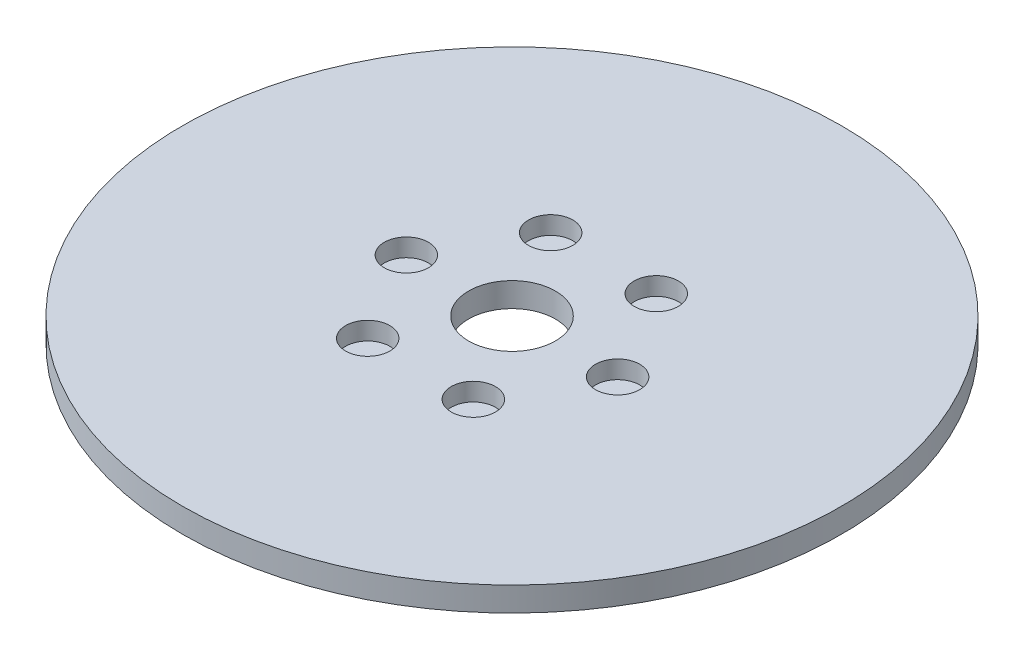
ISO-10303-21;
HEADER;
FILE_DESCRIPTION(('STEP AP214'),'2;1');
FILE_NAME('part.step','',(''),(''),'','','');
FILE_SCHEMA(('AUTOMOTIVE_DESIGN { 1 0 10303 214 1 1 1 1 }'));
ENDSEC;
DATA;
#1=APPLICATION_CONTEXT('core data for automotive mechanical design processes');
#2=APPLICATION_PROTOCOL_DEFINITION('international standard','automotive_design',2000,#1);
#3=PRODUCT_CONTEXT('',#1,'mechanical');
#4=PRODUCT('Part','Part','',(#3));
#5=PRODUCT_RELATED_PRODUCT_CATEGORY('part','',(#4));
#6=PRODUCT_DEFINITION_FORMATION('','',#4);
#7=PRODUCT_DEFINITION_CONTEXT('part definition',#1,'design');
#8=PRODUCT_DEFINITION('design','',#6,#7);
#9=PRODUCT_DEFINITION_SHAPE('','',#8);
#10=(LENGTH_UNIT() NAMED_UNIT(*) SI_UNIT(.MILLI.,.METRE.));
#11=(NAMED_UNIT(*) PLANE_ANGLE_UNIT() SI_UNIT($,.RADIAN.));
#12=(NAMED_UNIT(*) SI_UNIT($,.STERADIAN.) SOLID_ANGLE_UNIT());
#13=UNCERTAINTY_MEASURE_WITH_UNIT(LENGTH_MEASURE(1.E-05),#10,'distance_accuracy_value','');
#14=(GEOMETRIC_REPRESENTATION_CONTEXT(3) GLOBAL_UNCERTAINTY_ASSIGNED_CONTEXT((#13)) GLOBAL_UNIT_ASSIGNED_CONTEXT((#10,
#11,#12)) REPRESENTATION_CONTEXT('',''));
#15=CARTESIAN_POINT('',(0.,0.,0.));
#16=DIRECTION('',(0.,0.,1.));
#17=DIRECTION('',(1.,0.,0.));
#18=AXIS2_PLACEMENT_3D('',#15,#16,#17);
#19=CARTESIAN_POINT('',(0.,7.,0.));
#20=DIRECTION('',(0.,-1.,0.));
#21=DIRECTION('',(0.,0.,-1.));
#22=AXIS2_PLACEMENT_3D('',#19,#20,#21);
#23=CYLINDRICAL_SURFACE('',#22,95.);
#24=CARTESIAN_POINT('',(0.,7.,0.));
#25=DIRECTION('',(0.,1.,0.));
#26=DIRECTION('',(0.,0.,1.));
#27=AXIS2_PLACEMENT_3D('',#24,#25,#26);
#28=CIRCLE('',#27,95.);
#29=CARTESIAN_POINT('',(0.,7.,95.));
#30=VERTEX_POINT('',#29);
#31=EDGE_CURVE('E10',#30,#30,#28,.T.);
#32=ORIENTED_EDGE('',*,*,#31,.F.);
#33=EDGE_LOOP('',(#32));
#34=FACE_BOUND('',#33,.T.);
#35=CARTESIAN_POINT('',(0.,0.,0.));
#36=DIRECTION('',(0.,1.,0.));
#37=DIRECTION('',(0.,0.,1.));
#38=AXIS2_PLACEMENT_3D('',#35,#36,#37);
#39=CIRCLE('',#38,95.);
#40=CARTESIAN_POINT('',(0.,0.,95.));
#41=VERTEX_POINT('',#40);
#42=EDGE_CURVE('E37',#41,#41,#39,.T.);
#43=ORIENTED_EDGE('',*,*,#42,.T.);
#44=EDGE_LOOP('',(#43));
#45=FACE_BOUND('',#44,.T.);
#46=ADVANCED_FACE('F40',(#34,#45),#23,.T.);
#47=CARTESIAN_POINT('',(0.,7.,0.));
#48=DIRECTION('',(0.,1.,0.));
#49=DIRECTION('',(0.,0.,1.));
#50=AXIS2_PLACEMENT_3D('',#47,#48,#49);
#51=PLANE('',#50);
#52=CARTESIAN_POINT('',(-15.2232237533096,7.,-26.3673969957209));
#53=DIRECTION('',(0.,1.,0.));
#54=DIRECTION('',(-0.866025403784433,0.,0.50000000000001));
#55=AXIS2_PLACEMENT_3D('',#52,#53,#54);
#56=CIRCLE('',#55,6.36960719544827);
#57=CARTESIAN_POINT('',(-20.7394653966959,7.,-23.1825933979967));
#58=VERTEX_POINT('',#57);
#59=EDGE_CURVE('E70',#58,#58,#56,.T.);
#60=ORIENTED_EDGE('',*,*,#59,.F.);
#61=EDGE_LOOP('',(#60));
#62=FACE_BOUND('',#61,.T.);
#63=CARTESIAN_POINT('',(15.223223753309,7.,-26.3673969957212));
#64=DIRECTION('',(0.,1.,0.));
#65=DIRECTION('',(-0.866025403784443,0.,-0.499999999999992));
#66=AXIS2_PLACEMENT_3D('',#63,#64,#65);
#67=CIRCLE('',#66,6.36960719544827);
#68=CARTESIAN_POINT('',(9.70698210992265,7.,-29.5522005934453));
#69=VERTEX_POINT('',#68);
#70=EDGE_CURVE('E71',#69,#69,#67,.T.);
#71=ORIENTED_EDGE('',*,*,#70,.F.);
#72=EDGE_LOOP('',(#71));
#73=FACE_BOUND('',#72,.T.);
#74=CARTESIAN_POINT('',(30.4464475066186,7.,0.));
#75=DIRECTION('',(0.,1.,0.));
#76=DIRECTION('',(0.,0.,-1.));
#77=AXIS2_PLACEMENT_3D('',#74,#75,#76);
#78=CIRCLE('',#77,6.36960719544827);
#79=CARTESIAN_POINT('',(30.4464475066186,7.,-6.36960719544827));
#80=VERTEX_POINT('',#79);
#81=EDGE_CURVE('E78',#80,#80,#78,.T.);
#82=ORIENTED_EDGE('',*,*,#81,.F.);
#83=EDGE_LOOP('',(#82));
#84=FACE_BOUND('',#83,.T.);
#85=CARTESIAN_POINT('',(15.2232237533094,7.,26.367396995721));
#86=DIRECTION('',(0.,1.,0.));
#87=DIRECTION('',(0.866025403784436,0.,-0.500000000000004));
#88=AXIS2_PLACEMENT_3D('',#85,#86,#87);
#89=CIRCLE('',#88,6.36960719544827);
#90=CARTESIAN_POINT('',(20.7394653966957,7.,23.1825933979968));
#91=VERTEX_POINT('',#90);
#92=EDGE_CURVE('E84',#91,#91,#89,.T.);
#93=ORIENTED_EDGE('',*,*,#92,.F.);
#94=EDGE_LOOP('',(#93));
#95=FACE_BOUND('',#94,.T.);
#96=CARTESIAN_POINT('',(-15.2232237533092,7.,26.3673969957211));
#97=DIRECTION('',(0.,1.,0.));
#98=DIRECTION('',(0.86602540378444,0.,0.499999999999998));
#99=AXIS2_PLACEMENT_3D('',#96,#97,#98);
#100=CIRCLE('',#99,6.36960719544827);
#101=CARTESIAN_POINT('',(-9.70698210992286,7.,29.5522005934452));
#102=VERTEX_POINT('',#101);
#103=EDGE_CURVE('E61',#102,#102,#100,.T.);
#104=ORIENTED_EDGE('',*,*,#103,.F.);
#105=EDGE_LOOP('',(#104));
#106=FACE_BOUND('',#105,.T.);
#107=CARTESIAN_POINT('',(-30.4464475066186,7.,0.));
#108=DIRECTION('',(0.,1.,0.));
#109=DIRECTION('',(0.,0.,1.));
#110=AXIS2_PLACEMENT_3D('',#107,#108,#109);
#111=CIRCLE('',#110,6.36960719544827);
#112=CARTESIAN_POINT('',(-30.4464475066186,7.,6.36960719544827));
#113=VERTEX_POINT('',#112);
#114=EDGE_CURVE('E54',#113,#113,#111,.T.);
#115=ORIENTED_EDGE('',*,*,#114,.F.);
#116=EDGE_LOOP('',(#115));
#117=FACE_BOUND('',#116,.T.);
#118=CARTESIAN_POINT('',(0.,7.,0.));
#119=DIRECTION('',(0.,1.,0.));
#120=DIRECTION('',(0.,0.,1.));
#121=AXIS2_PLACEMENT_3D('',#118,#119,#120);
#122=CIRCLE('',#121,12.5);
#123=CARTESIAN_POINT('',(0.,7.,12.5));
#124=VERTEX_POINT('',#123);
#125=EDGE_CURVE('E50',#124,#124,#122,.T.);
#126=ORIENTED_EDGE('',*,*,#125,.F.);
#127=EDGE_LOOP('',(#126));
#128=FACE_BOUND('',#127,.T.);
#129=ORIENTED_EDGE('',*,*,#31,.T.);
#130=EDGE_LOOP('',(#129));
#131=FACE_BOUND('',#130,.T.);
#132=ADVANCED_FACE('F99',(#62,#73,#84,#95,#106,#117,#128,#131),#51,.T.);
#133=CARTESIAN_POINT('',(0.,0.,0.));
#134=DIRECTION('',(0.,1.,0.));
#135=DIRECTION('',(0.,0.,1.));
#136=AXIS2_PLACEMENT_3D('',#133,#134,#135);
#137=PLANE('',#136);
#138=CARTESIAN_POINT('',(0.,0.,0.));
#139=DIRECTION('',(0.,1.,0.));
#140=DIRECTION('',(0.,0.,1.));
#141=AXIS2_PLACEMENT_3D('',#138,#139,#140);
#142=CIRCLE('',#141,12.5);
#143=CARTESIAN_POINT('',(0.,0.,12.5));
#144=VERTEX_POINT('',#143);
#145=EDGE_CURVE('E47',#144,#144,#142,.T.);
#146=ORIENTED_EDGE('',*,*,#145,.T.);
#147=EDGE_LOOP('',(#146));
#148=FACE_BOUND('',#147,.T.);
#149=ORIENTED_EDGE('',*,*,#42,.F.);
#150=EDGE_LOOP('',(#149));
#151=FACE_BOUND('',#150,.T.);
#152=ADVANCED_FACE('F103',(#148,#151),#137,.F.);
#153=CARTESIAN_POINT('',(0.,7.,0.));
#154=DIRECTION('',(0.,-1.,0.));
#155=DIRECTION('',(0.,0.,-1.));
#156=AXIS2_PLACEMENT_3D('',#153,#154,#155);
#157=CYLINDRICAL_SURFACE('',#156,12.5);
#158=ORIENTED_EDGE('',*,*,#125,.T.);
#159=EDGE_LOOP('',(#158));
#160=FACE_BOUND('',#159,.T.);
#161=ORIENTED_EDGE('',*,*,#145,.F.);
#162=EDGE_LOOP('',(#161));
#163=FACE_BOUND('',#162,.T.);
#164=ADVANCED_FACE('F115',(#160,#163),#157,.F.);
#165=CARTESIAN_POINT('',(-30.4464475066186,1.82037238060485,0.));
#166=DIRECTION('',(0.,1.,0.));
#167=DIRECTION('',(0.,0.,1.));
#168=AXIS2_PLACEMENT_3D('',#165,#166,#167);
#169=CYLINDRICAL_SURFACE('',#168,6.36960719544827);
#170=CARTESIAN_POINT('',(-30.4464475066186,1.82037238060485,0.));
#171=DIRECTION('',(0.,1.,0.));
#172=DIRECTION('',(0.,0.,1.));
#173=AXIS2_PLACEMENT_3D('',#170,#171,#172);
#174=CIRCLE('',#173,6.36960719544827);
#175=CARTESIAN_POINT('',(-30.4464475066186,1.82037238060485,6.36960719544827));
#176=VERTEX_POINT('',#175);
#177=EDGE_CURVE('E55',#176,#176,#174,.T.);
#178=ORIENTED_EDGE('',*,*,#177,.F.);
#179=EDGE_LOOP('',(#178));
#180=FACE_BOUND('',#179,.T.);
#181=ORIENTED_EDGE('',*,*,#114,.T.);
#182=EDGE_LOOP('',(#181));
#183=FACE_BOUND('',#182,.T.);
#184=ADVANCED_FACE('F113',(#180,#183),#169,.F.);
#185=CARTESIAN_POINT('',(-30.4464475066186,1.82037238060485,0.));
#186=DIRECTION('',(0.,1.,0.));
#187=DIRECTION('',(0.,0.,1.));
#188=AXIS2_PLACEMENT_3D('',#185,#186,#187);
#189=PLANE('',#188);
#190=ORIENTED_EDGE('',*,*,#177,.T.);
#191=EDGE_LOOP('',(#190));
#192=FACE_BOUND('',#191,.T.);
#193=ADVANCED_FACE('F144',(#192),#189,.T.);
#194=CARTESIAN_POINT('',(-15.2232237533092,1.82037238060485,26.3673969957211));
#195=DIRECTION('',(0.,1.,0.));
#196=DIRECTION('',(0.,0.,1.));
#197=AXIS2_PLACEMENT_3D('',#194,#195,#196);
#198=CYLINDRICAL_SURFACE('',#197,6.36960719544827);
#199=CARTESIAN_POINT('',(-15.2232237533092,1.82037238060485,26.3673969957211));
#200=DIRECTION('',(0.,1.,0.));
#201=DIRECTION('',(0.86602540378444,0.,0.499999999999998));
#202=AXIS2_PLACEMENT_3D('',#199,#200,#201);
#203=CIRCLE('',#202,6.36960719544827);
#204=CARTESIAN_POINT('',(-9.70698210992286,1.82037238060485,29.5522005934452));
#205=VERTEX_POINT('',#204);
#206=EDGE_CURVE('E59',#205,#205,#203,.T.);
#207=ORIENTED_EDGE('',*,*,#206,.F.);
#208=EDGE_LOOP('',(#207));
#209=FACE_BOUND('',#208,.T.);
#210=ORIENTED_EDGE('',*,*,#103,.T.);
#211=EDGE_LOOP('',(#210));
#212=FACE_BOUND('',#211,.T.);
#213=ADVANCED_FACE('F153',(#209,#212),#198,.F.);
#214=CARTESIAN_POINT('',(-15.2232237533092,1.82037238060485,26.3673969957211));
#215=DIRECTION('',(0.,1.,0.));
#216=DIRECTION('',(0.86602540378444,0.,0.499999999999998));
#217=AXIS2_PLACEMENT_3D('',#214,#215,#216);
#218=PLANE('',#217);
#219=ORIENTED_EDGE('',*,*,#206,.T.);
#220=EDGE_LOOP('',(#219));
#221=FACE_BOUND('',#220,.T.);
#222=ADVANCED_FACE('F96',(#221),#218,.T.);
#223=CARTESIAN_POINT('',(15.2232237533094,1.82037238060485,26.367396995721));
#224=DIRECTION('',(0.,1.,0.));
#225=DIRECTION('',(0.,0.,1.));
#226=AXIS2_PLACEMENT_3D('',#223,#224,#225);
#227=CYLINDRICAL_SURFACE('',#226,6.36960719544827);
#228=CARTESIAN_POINT('',(15.2232237533094,1.82037238060485,26.367396995721));
#229=DIRECTION('',(0.,1.,0.));
#230=DIRECTION('',(0.866025403784436,0.,-0.500000000000004));
#231=AXIS2_PLACEMENT_3D('',#228,#229,#230);
#232=CIRCLE('',#231,6.36960719544827);
#233=CARTESIAN_POINT('',(20.7394653966957,1.82037238060485,23.1825933979968));
#234=VERTEX_POINT('',#233);
#235=EDGE_CURVE('E63',#234,#234,#232,.T.);
#236=ORIENTED_EDGE('',*,*,#235,.F.);
#237=EDGE_LOOP('',(#236));
#238=FACE_BOUND('',#237,.T.);
#239=ORIENTED_EDGE('',*,*,#92,.T.);
#240=EDGE_LOOP('',(#239));
#241=FACE_BOUND('',#240,.T.);
#242=ADVANCED_FACE('F91',(#238,#241),#227,.F.);
#243=CARTESIAN_POINT('',(15.2232237533094,1.82037238060485,26.367396995721));
#244=DIRECTION('',(0.,1.,0.));
#245=DIRECTION('',(0.866025403784436,0.,-0.500000000000004));
#246=AXIS2_PLACEMENT_3D('',#243,#244,#245);
#247=PLANE('',#246);
#248=ORIENTED_EDGE('',*,*,#235,.T.);
#249=EDGE_LOOP('',(#248));
#250=FACE_BOUND('',#249,.T.);
#251=ADVANCED_FACE('F93',(#250),#247,.T.);
#252=CARTESIAN_POINT('',(30.4464475066186,1.82037238060485,0.));
#253=DIRECTION('',(0.,1.,0.));
#254=DIRECTION('',(0.,0.,1.));
#255=AXIS2_PLACEMENT_3D('',#252,#253,#254);
#256=CYLINDRICAL_SURFACE('',#255,6.36960719544827);
#257=CARTESIAN_POINT('',(30.4464475066186,1.82037238060485,0.));
#258=DIRECTION('',(0.,1.,0.));
#259=DIRECTION('',(0.,0.,-1.));
#260=AXIS2_PLACEMENT_3D('',#257,#258,#259);
#261=CIRCLE('',#260,6.36960719544827);
#262=CARTESIAN_POINT('',(30.4464475066186,1.82037238060485,-6.36960719544827));
#263=VERTEX_POINT('',#262);
#264=EDGE_CURVE('E85',#263,#263,#261,.T.);
#265=ORIENTED_EDGE('',*,*,#264,.F.);
#266=EDGE_LOOP('',(#265));
#267=FACE_BOUND('',#266,.T.);
#268=ORIENTED_EDGE('',*,*,#81,.T.);
#269=EDGE_LOOP('',(#268));
#270=FACE_BOUND('',#269,.T.);
#271=ADVANCED_FACE('F187',(#267,#270),#256,.F.);
#272=CARTESIAN_POINT('',(30.4464475066186,1.82037238060485,0.));
#273=DIRECTION('',(0.,1.,0.));
#274=DIRECTION('',(0.,0.,-1.));
#275=AXIS2_PLACEMENT_3D('',#272,#273,#274);
#276=PLANE('',#275);
#277=ORIENTED_EDGE('',*,*,#264,.T.);
#278=EDGE_LOOP('',(#277));
#279=FACE_BOUND('',#278,.T.);
#280=ADVANCED_FACE('F198',(#279),#276,.T.);
#281=CARTESIAN_POINT('',(15.223223753309,1.82037238060485,-26.3673969957212));
#282=DIRECTION('',(0.,1.,0.));
#283=DIRECTION('',(0.,0.,1.));
#284=AXIS2_PLACEMENT_3D('',#281,#282,#283);
#285=CYLINDRICAL_SURFACE('',#284,6.36960719544827);
#286=CARTESIAN_POINT('',(15.223223753309,1.82037238060485,-26.3673969957212));
#287=DIRECTION('',(0.,1.,0.));
#288=DIRECTION('',(-0.866025403784443,0.,-0.499999999999992));
#289=AXIS2_PLACEMENT_3D('',#286,#287,#288);
#290=CIRCLE('',#289,6.36960719544827);
#291=CARTESIAN_POINT('',(9.70698210992265,1.82037238060485,-29.5522005934453));
#292=VERTEX_POINT('',#291);
#293=EDGE_CURVE('E76',#292,#292,#290,.T.);
#294=ORIENTED_EDGE('',*,*,#293,.F.);
#295=EDGE_LOOP('',(#294));
#296=FACE_BOUND('',#295,.T.);
#297=ORIENTED_EDGE('',*,*,#70,.T.);
#298=EDGE_LOOP('',(#297));
#299=FACE_BOUND('',#298,.T.);
#300=ADVANCED_FACE('F202',(#296,#299),#285,.F.);
#301=CARTESIAN_POINT('',(15.223223753309,1.82037238060485,-26.3673969957212));
#302=DIRECTION('',(0.,1.,0.));
#303=DIRECTION('',(-0.866025403784443,0.,-0.499999999999992));
#304=AXIS2_PLACEMENT_3D('',#301,#302,#303);
#305=PLANE('',#304);
#306=ORIENTED_EDGE('',*,*,#293,.T.);
#307=EDGE_LOOP('',(#306));
#308=FACE_BOUND('',#307,.T.);
#309=ADVANCED_FACE('F212',(#308),#305,.T.);
#310=CARTESIAN_POINT('',(-15.2232237533096,1.82037238060485,-26.3673969957209));
#311=DIRECTION('',(0.,1.,0.));
#312=DIRECTION('',(0.,0.,1.));
#313=AXIS2_PLACEMENT_3D('',#310,#311,#312);
#314=CYLINDRICAL_SURFACE('',#313,6.36960719544827);
#315=CARTESIAN_POINT('',(-15.2232237533096,1.82037238060485,-26.3673969957209));
#316=DIRECTION('',(0.,1.,0.));
#317=DIRECTION('',(-0.866025403784433,0.,0.50000000000001));
#318=AXIS2_PLACEMENT_3D('',#315,#316,#317);
#319=CIRCLE('',#318,6.36960719544827);
#320=CARTESIAN_POINT('',(-20.7394653966959,1.82037238060485,-23.1825933979967));
#321=VERTEX_POINT('',#320);
#322=EDGE_CURVE('E69',#321,#321,#319,.T.);
#323=ORIENTED_EDGE('',*,*,#322,.F.);
#324=EDGE_LOOP('',(#323));
#325=FACE_BOUND('',#324,.T.);
#326=ORIENTED_EDGE('',*,*,#59,.T.);
#327=EDGE_LOOP('',(#326));
#328=FACE_BOUND('',#327,.T.);
#329=ADVANCED_FACE('F224',(#325,#328),#314,.F.);
#330=CARTESIAN_POINT('',(-15.2232237533096,1.82037238060485,-26.3673969957209));
#331=DIRECTION('',(0.,1.,0.));
#332=DIRECTION('',(-0.866025403784433,0.,0.50000000000001));
#333=AXIS2_PLACEMENT_3D('',#330,#331,#332);
#334=PLANE('',#333);
#335=ORIENTED_EDGE('',*,*,#322,.T.);
#336=EDGE_LOOP('',(#335));
#337=FACE_BOUND('',#336,.T.);
#338=ADVANCED_FACE('F235',(#337),#334,.T.);
#339=CLOSED_SHELL('',(#46,#132,#152,#164,#184,#193,#213,#222,#242,#251,#271,#280,#300,#309,#329,#338));
#340=MANIFOLD_SOLID_BREP('B2',#339);
#341=ADVANCED_BREP_SHAPE_REPRESENTATION('',(#18,#340),#14);
#342=SHAPE_DEFINITION_REPRESENTATION(#9,#341);
ENDSEC;
END-ISO-10303-21;
